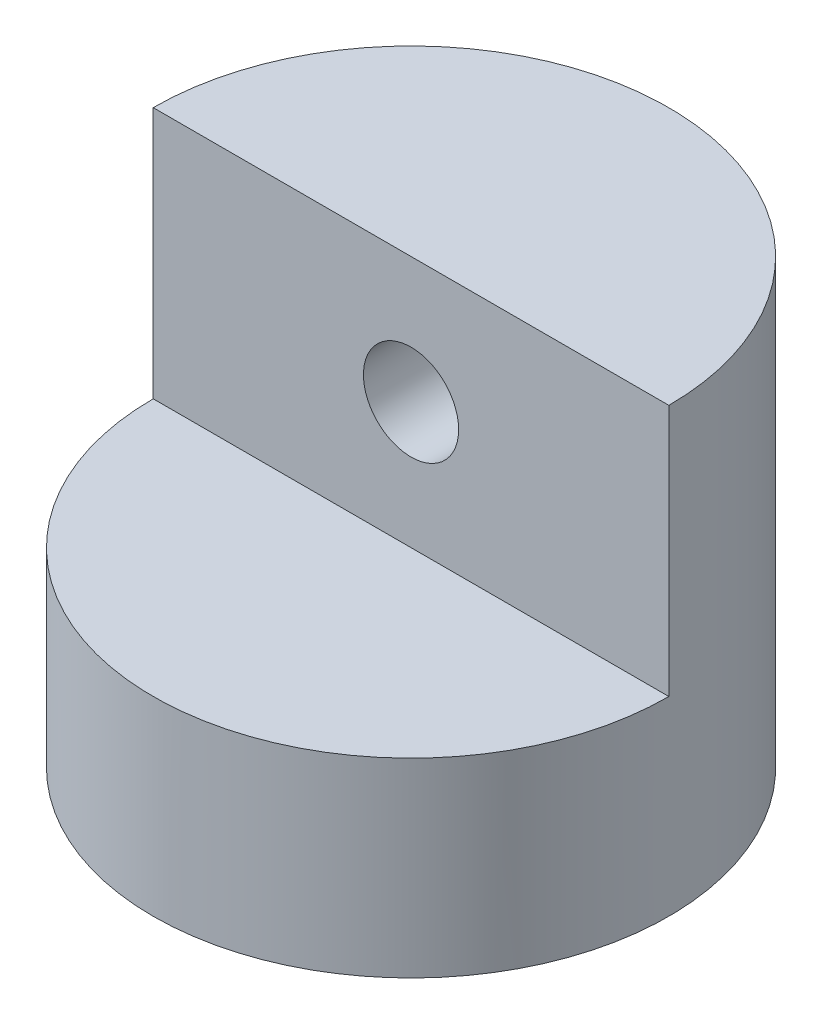
ISO-10303-21;
HEADER;
FILE_DESCRIPTION(('STEP AP214'),'2;1');
FILE_NAME('part.step','',(''),(''),'','','');
FILE_SCHEMA(('AUTOMOTIVE_DESIGN { 1 0 10303 214 1 1 1 1 }'));
ENDSEC;
DATA;
#1=APPLICATION_CONTEXT('core data for automotive mechanical design processes');
#2=APPLICATION_PROTOCOL_DEFINITION('international standard','automotive_design',2000,#1);
#3=PRODUCT_CONTEXT('',#1,'mechanical');
#4=PRODUCT('Part','Part','',(#3));
#5=PRODUCT_RELATED_PRODUCT_CATEGORY('part','',(#4));
#6=PRODUCT_DEFINITION_FORMATION('','',#4);
#7=PRODUCT_DEFINITION_CONTEXT('part definition',#1,'design');
#8=PRODUCT_DEFINITION('design','',#6,#7);
#9=PRODUCT_DEFINITION_SHAPE('','',#8);
#10=(LENGTH_UNIT() NAMED_UNIT(*) SI_UNIT(.MILLI.,.METRE.));
#11=(NAMED_UNIT(*) PLANE_ANGLE_UNIT() SI_UNIT($,.RADIAN.));
#12=(NAMED_UNIT(*) SI_UNIT($,.STERADIAN.) SOLID_ANGLE_UNIT());
#13=UNCERTAINTY_MEASURE_WITH_UNIT(LENGTH_MEASURE(1.E-05),#10,'distance_accuracy_value','');
#14=(GEOMETRIC_REPRESENTATION_CONTEXT(3) GLOBAL_UNCERTAINTY_ASSIGNED_CONTEXT((#13)) GLOBAL_UNIT_ASSIGNED_CONTEXT((#10,
#11,#12)) REPRESENTATION_CONTEXT('',''));
#15=CARTESIAN_POINT('',(0.,0.,0.));
#16=DIRECTION('',(0.,0.,1.));
#17=DIRECTION('',(1.,0.,0.));
#18=AXIS2_PLACEMENT_3D('',#15,#16,#17);
#19=CARTESIAN_POINT('',(0.,55.788,0.));
#20=DIRECTION('',(0.,-1.,0.));
#21=DIRECTION('',(0.,0.,-1.));
#22=AXIS2_PLACEMENT_3D('',#19,#20,#21);
#23=CYLINDRICAL_SURFACE('',#22,32.5);
#24=CARTESIAN_POINT('',(0.,45.894,-32.5));
#25=CARTESIAN_POINT('',(-0.167047387974414,45.8940029510479,-32.5000014014323));
#26=CARTESIAN_POINT('',(-0.334056414535265,45.8870218137109,-32.498709777994));
#27=CARTESIAN_POINT('',(-0.666922031200577,45.8591570671439,-32.4935823968578));
#28=CARTESIAN_POINT('',(-0.83277840485818,45.8382709144761,-32.4897461737147));
#29=CARTESIAN_POINT('',(-1.16218709311425,45.7827385369716,-32.4796320956752));
#30=CARTESIAN_POINT('',(-1.32573803450885,45.7480844426081,-32.4733528444273));
#31=CARTESIAN_POINT('',(-1.64934345668916,45.6652710411314,-32.4585259988948));
#32=CARTESIAN_POINT('',(-1.80939663010089,45.6171067742799,-32.449977571632));
#33=CARTESIAN_POINT('',(-2.12461909376535,45.5077146641441,-32.4308633624607));
#34=CARTESIAN_POINT('',(-2.27979434281073,45.4465035317315,-32.4203001629443));
#35=CARTESIAN_POINT('',(-2.58446206954015,45.3114103037928,-32.3974366809218));
#36=CARTESIAN_POINT('',(-2.73395242740515,45.2375235372098,-32.3851357583491));
#37=CARTESIAN_POINT('',(-3.0261060502108,45.0776663224003,-32.3591437290318));
#38=CARTESIAN_POINT('',(-3.16877249289802,44.9917015735252,-32.3454532788178));
#39=CARTESIAN_POINT('',(-3.44644953798865,44.808233178875,-32.3170461894859));
#40=CARTESIAN_POINT('',(-3.5814572600222,44.7107252338195,-32.3023291688641));
#41=CARTESIAN_POINT('',(-3.84417623264325,44.5038314026624,-32.2721237443791));
#42=CARTESIAN_POINT('',(-3.97180053780938,44.3943360118484,-32.2566290755317));
#43=CARTESIAN_POINT('',(-4.21744501771729,44.1649955424505,-32.2254324395731));
#44=CARTESIAN_POINT('',(-4.33546161754137,44.0451466453241,-32.2097303978036));
#45=CARTESIAN_POINT('',(-4.56100087376238,43.7959866047547,-32.1785678807607));
#46=CARTESIAN_POINT('',(-4.6685266280766,43.6666782745123,-32.1631073353135));
#47=CARTESIAN_POINT('',(-4.87241936155105,43.3993949339145,-32.1328517105622));
#48=CARTESIAN_POINT('',(-4.96878221059233,43.2614167447701,-32.1180568787931));
#49=CARTESIAN_POINT('',(-5.15028638072951,42.976734596099,-32.0894539852934));
#50=CARTESIAN_POINT('',(-5.23534055334004,42.8299742402162,-32.075653924559));
#51=CARTESIAN_POINT('',(-5.39279796033512,42.5296208403625,-32.0495569658406));
#52=CARTESIAN_POINT('',(-5.46519645843931,42.3760252652317,-32.0372606311283));
#53=CARTESIAN_POINT('',(-5.59673049546194,42.0631866292106,-32.0145447471987));
#54=CARTESIAN_POINT('',(-5.65587180506681,41.9039460606101,-32.0041243817861));
#55=CARTESIAN_POINT('',(-5.760491398177,41.5808973563502,-31.9854579827382));
#56=CARTESIAN_POINT('',(-5.80596470935163,41.4170875820687,-31.9772127405319));
#57=CARTESIAN_POINT('',(-5.92036897645239,40.9244091594295,-31.9563064605375));
#58=CARTESIAN_POINT('',(-5.9689190107169,40.5903867325286,-31.9471824578801));
#59=CARTESIAN_POINT('',(-6.0093777303918,39.9190057786916,-31.9395955731685));
#60=CARTESIAN_POINT('',(-6.00129133836947,39.5816475442331,-31.9411317645811));
#61=CARTESIAN_POINT('',(-5.92929348899846,38.9174903955482,-31.9545734655921));
#62=CARTESIAN_POINT('',(-5.86609521960248,38.5906116881623,-31.9663464973696));
#63=CARTESIAN_POINT('',(-5.68676990030916,37.9521907023755,-31.9987323168555));
#64=CARTESIAN_POINT('',(-5.57064066366295,37.6406490581874,-32.0193454697757));
#65=CARTESIAN_POINT('',(-5.28805391152012,37.0396356158523,-32.0672268492818));
#66=CARTESIAN_POINT('',(-5.12130716064854,36.750302952439,-32.0945331440214));
#67=CARTESIAN_POINT('',(-4.74242193954203,36.2034561794701,-32.1526990787035));
#68=CARTESIAN_POINT('',(-4.530278998731,35.9459452076288,-32.1835590684723));
#69=CARTESIAN_POINT('',(-4.06277153030441,35.4659275275267,-32.2459333357088));
#70=CARTESIAN_POINT('',(-3.80679653324245,35.2440153110494,-32.2774504088927));
#71=CARTESIAN_POINT('',(-3.26093695329242,34.8461940455438,-32.3371543132372));
#72=CARTESIAN_POINT('',(-2.9710520498581,34.6702854314329,-32.3653411129122));
#73=CARTESIAN_POINT('',(-2.36499021324983,34.3693819960959,-32.4152628733547));
#74=CARTESIAN_POINT('',(-2.04878258243286,34.2444476517934,-32.4369901621846));
#75=CARTESIAN_POINT('',(-1.39937919492225,34.0496330704814,-32.4714852504939));
#76=CARTESIAN_POINT('',(-1.06618519067572,33.9797471664329,-32.4842539722107));
#77=CARTESIAN_POINT('',(-0.397383215203505,33.897837604151,-32.4992669465579));
#78=CARTESIAN_POINT('',(-0.061878248374556,33.8849991718894,-32.5016593853383));
#79=CARTESIAN_POINT('',(0.606484909661265,33.9153653821447,-32.4960590637379));
#80=CARTESIAN_POINT('',(0.939343226021668,33.958567358601,-32.4880667973981));
#81=CARTESIAN_POINT('',(1.59038992422883,34.0991105543012,-32.4626872786007));
#82=CARTESIAN_POINT('',(1.90867005010831,34.1960407881008,-32.4453713741909));
#83=CARTESIAN_POINT('',(2.52446187534885,34.4408453063712,-32.4032781211012));
#84=CARTESIAN_POINT('',(2.82197219688195,34.5887229667393,-32.3785002779893));
#85=CARTESIAN_POINT('',(3.39126548533967,34.9330367309458,-32.3238620342218));
#86=CARTESIAN_POINT('',(3.66274135122632,35.1299723034668,-32.2939504055836));
#87=CARTESIAN_POINT('',(4.16908432952835,35.5661353462449,-32.2324977111764));
#88=CARTESIAN_POINT('',(4.40394813141742,35.805366636785,-32.2009564984004));
#89=CARTESIAN_POINT('',(4.83348551479758,36.323009489889,-32.1393095123828));
#90=CARTESIAN_POINT('',(5.02760384169284,36.6018850371774,-32.1092273941104));
#91=CARTESIAN_POINT('',(5.36623841659489,37.1887786280097,-32.0543763326784));
#92=CARTESIAN_POINT('',(5.51075647264598,37.4967956087587,-32.0296071958606));
#93=CARTESIAN_POINT('',(5.74529998594316,38.1317338687607,-31.9883683472532));
#94=CARTESIAN_POINT('',(5.83558308225324,38.4585575558546,-31.9718594593372));
#95=CARTESIAN_POINT('',(5.9598710985257,39.1232555270963,-31.9489294956881));
#96=CARTESIAN_POINT('',(5.9938821523063,39.4611286027335,-31.9425073204774));
#97=CARTESIAN_POINT('',(6.00189486714629,39.9656781389392,-31.9409937887346));
#98=CARTESIAN_POINT('',(5.99758283494899,40.1322741196854,-31.9418077558083));
#99=CARTESIAN_POINT('',(5.97513253775215,40.4644821130812,-31.9460164877228));
#100=CARTESIAN_POINT('',(5.95699949373228,40.6300944734976,-31.949410278017));
#101=CARTESIAN_POINT('',(5.90703362997939,40.9592156204855,-31.9586855963114));
#102=CARTESIAN_POINT('',(5.87519596756223,41.122723642411,-31.9645680036804));
#103=CARTESIAN_POINT('',(5.79808429743152,41.4463782726521,-31.9786453020169));
#104=CARTESIAN_POINT('',(5.75281510317848,41.6065260631974,-31.9868393645045));
#105=CARTESIAN_POINT('',(5.6492524053349,41.9221766222262,-32.00529184354));
#106=CARTESIAN_POINT('',(5.59097742811479,42.0776856447824,-32.0155473216154));
#107=CARTESIAN_POINT('',(5.46182056358106,42.3831782049627,-32.0378339830431));
#108=CARTESIAN_POINT('',(5.39094316290595,42.5331636861804,-32.049864534186));
#109=CARTESIAN_POINT('',(5.2370452771777,42.8267176587837,-32.0753712303171));
#110=CARTESIAN_POINT('',(5.154019883669,42.9702835255336,-32.0888479590508));
#111=CARTESIAN_POINT('',(4.97646002457542,43.2499304658904,-32.1168634444833));
#112=CARTESIAN_POINT('',(4.88192955508219,43.3860141146111,-32.1314018317353));
#113=CARTESIAN_POINT('',(4.68049098336988,43.6518217116084,-32.1613669342853));
#114=CARTESIAN_POINT('',(4.57341948284921,43.7814207338574,-32.1768036560179));
#115=CARTESIAN_POINT('',(4.34884138360294,44.0311204389516,-32.2079248208257));
#116=CARTESIAN_POINT('',(4.23133849380697,44.1512244692991,-32.2236091742366));
#117=CARTESIAN_POINT('',(3.98659111868758,44.3812385155566,-32.2548029719053));
#118=CARTESIAN_POINT('',(3.85934088957489,44.4911424352006,-32.2703123067585));
#119=CARTESIAN_POINT('',(3.59607102507716,44.6998801206826,-32.3007093143119));
#120=CARTESIAN_POINT('',(3.46005463969105,44.7987179524275,-32.3155972140706));
#121=CARTESIAN_POINT('',(3.17885786431139,44.9855234946824,-32.3444742543555));
#122=CARTESIAN_POINT('',(3.03360543194256,45.073384266206,-32.3584539984354));
#123=CARTESIAN_POINT('',(2.7361329268486,45.2365033626235,-32.384963576446));
#124=CARTESIAN_POINT('',(2.58391544613779,45.3117663279433,-32.3974939437296));
#125=CARTESIAN_POINT('',(2.27362825228653,45.4491215890459,-32.4207463085122));
#126=CARTESIAN_POINT('',(2.11556241225018,45.5112224244255,-32.4314694775916));
#127=CARTESIAN_POINT('',(1.79467228319851,45.6218233939829,-32.4508090321666));
#128=CARTESIAN_POINT('',(1.63184896912177,45.6703262934676,-32.4594258459698));
#129=CARTESIAN_POINT('',(1.22783758338943,45.7722046076489,-32.4776798969894));
#130=CARTESIAN_POINT('',(0.984588736194169,45.8178195540128,-32.4860086220748));
#131=CARTESIAN_POINT('',(0.494198560196146,45.8787147022365,-32.4971675709575));
#132=CARTESIAN_POINT('',(0.247057325390456,45.893995635502,-32.4999979273299));
#133=CARTESIAN_POINT('',(0.,45.894,-32.5));
#134=B_SPLINE_CURVE_WITH_KNOTS('',3,(#24,#25,#26,#27,#28,#29,#30,#31,#32,#33,#34,#35,#36,#37,
#38,#39,#40,#41,#42,#43,#44,#45,#46,#47,#48,#49,#50,#51,#52,#53,#54,#55,#56,#57,#58,#59,#60,#61,
#62,#63,#64,#65,#66,#67,#68,#69,#70,#71,#72,#73,#74,#75,#76,#77,#78,#79,#80,#81,#82,#83,#84,#85,
#86,#87,#88,#89,#90,#91,#92,#93,#94,#95,#96,#97,#98,#99,#100,#101,#102,#103,#104,#105,#106,#107,
#108,#109,#110,#111,#112,#113,#114,#115,#116,#117,#118,#119,#120,#121,#122,#123,#124,#125,#126,
#127,#128,#129,#130,#131,#132,#133),.UNSPECIFIED.,.T.,.F.,(4,2,2,2,2,2,2,2,2,2,2,2,2,2,2,2,2,2,
2,2,2,2,2,2,2,2,2,2,2,2,2,2,2,2,2,2,2,2,2,2,2,2,2,2,2,2,2,2,2,2,2,2,2,2,4),(0.,
0.500925415856107,1.00194248373588,1.50324633759921,2.00473446721871,2.50558409263793,
3.00661868254917,3.5074176336936,4.00840369848706,4.51442366052909,5.02063105435911,
5.52668851124022,6.03293260831374,6.5428761417078,7.05301011052262,7.56292159140477,
8.07301835093451,9.0806475845946,10.088189241028,11.0828828743721,12.0776176054417,
13.0781469402784,14.0787748517291,15.0946807664378,16.1105962851585,17.1277136264852,
18.144726245551,19.147165819545,20.1495577053301,21.1443857119725,22.1392796509597,
23.1447493595254,24.1503099317355,25.1687925873859,26.1872381130497,27.2008065243771,
28.2142644464847,28.7137382676778,29.2130235027488,29.7124853110036,30.2117683427893,
30.7103446486532,31.2087438085096,31.7073449079496,32.2057733184101,32.711626137455,
33.2172998130326,33.7232737924587,34.2290612523622,34.7394448349454,35.2496400010552,
35.7595031320703,36.2692625008281,37.0101317779487,37.7509831912043),.UNSPECIFIED.);
#135=CARTESIAN_POINT('',(0.,45.894,-32.5));
#136=VERTEX_POINT('',#135);
#137=EDGE_CURVE('E88',#136,#136,#134,.T.);
#138=ORIENTED_EDGE('',*,*,#137,.T.);
#139=EDGE_LOOP('',(#138));
#140=FACE_BOUND('',#139,.T.);
#141=CARTESIAN_POINT('',(0.,0.,0.));
#142=DIRECTION('',(0.,1.,0.));
#143=DIRECTION('',(0.,0.,1.));
#144=AXIS2_PLACEMENT_3D('',#141,#142,#143);
#145=CIRCLE('',#144,32.5);
#146=CARTESIAN_POINT('',(0.,0.,32.5));
#147=VERTEX_POINT('',#146);
#148=EDGE_CURVE('E75',#147,#147,#145,.T.);
#149=ORIENTED_EDGE('',*,*,#148,.T.);
#150=EDGE_LOOP('',(#149));
#151=FACE_BOUND('',#150,.T.);
#152=DIRECTION('',(0.,1.,0.));
#153=VECTOR('',#152,1.);
#154=CARTESIAN_POINT('',(-32.5,24.,0.));
#155=LINE('',#154,#153);
#156=CARTESIAN_POINT('',(-32.5,24.,0.));
#157=VERTEX_POINT('',#156);
#158=CARTESIAN_POINT('',(-32.5,55.788,0.));
#159=VERTEX_POINT('',#158);
#160=EDGE_CURVE('E64',#157,#159,#155,.T.);
#161=ORIENTED_EDGE('',*,*,#160,.T.);
#162=CARTESIAN_POINT('',(0.,55.788,0.));
#163=DIRECTION('',(0.,1.,0.));
#164=DIRECTION('',(0.,0.,1.));
#165=AXIS2_PLACEMENT_3D('',#162,#163,#164);
#166=CIRCLE('',#165,32.5);
#167=CARTESIAN_POINT('',(32.5,55.788,0.));
#168=VERTEX_POINT('',#167);
#169=EDGE_CURVE('E44',#168,#159,#166,.T.);
#170=ORIENTED_EDGE('',*,*,#169,.F.);
#171=DIRECTION('',(0.,1.,0.));
#172=VECTOR('',#171,1.);
#173=CARTESIAN_POINT('',(32.5,24.,0.));
#174=LINE('',#173,#172);
#175=CARTESIAN_POINT('',(32.5,24.,0.));
#176=VERTEX_POINT('',#175);
#177=EDGE_CURVE('E51',#176,#168,#174,.T.);
#178=ORIENTED_EDGE('',*,*,#177,.F.);
#179=CARTESIAN_POINT('',(0.,24.,0.));
#180=DIRECTION('',(0.,1.,0.));
#181=DIRECTION('',(0.,0.,1.));
#182=AXIS2_PLACEMENT_3D('',#179,#180,#181);
#183=CIRCLE('',#182,32.5);
#184=EDGE_CURVE('E72',#157,#176,#183,.T.);
#185=ORIENTED_EDGE('',*,*,#184,.F.);
#186=EDGE_LOOP('',(#161,#170,#178,#185));
#187=FACE_BOUND('',#186,.T.);
#188=ADVANCED_FACE('F36',(#140,#151,#187),#23,.T.);
#189=CARTESIAN_POINT('',(0.,55.788,0.));
#190=DIRECTION('',(0.,1.,0.));
#191=DIRECTION('',(0.,0.,1.));
#192=AXIS2_PLACEMENT_3D('',#189,#190,#191);
#193=PLANE('',#192);
#194=ORIENTED_EDGE('',*,*,#169,.T.);
#195=DIRECTION('',(1.,0.,0.));
#196=VECTOR('',#195,1.);
#197=CARTESIAN_POINT('',(0.,55.788,0.));
#198=LINE('',#197,#196);
#199=EDGE_CURVE('E61',#159,#168,#198,.T.);
#200=ORIENTED_EDGE('',*,*,#199,.T.);
#201=EDGE_LOOP('',(#194,#200));
#202=FACE_BOUND('',#201,.T.);
#203=ADVANCED_FACE('F74',(#202),#193,.T.);
#204=CARTESIAN_POINT('',(0.,0.,0.));
#205=DIRECTION('',(0.,1.,0.));
#206=DIRECTION('',(0.,0.,1.));
#207=AXIS2_PLACEMENT_3D('',#204,#205,#206);
#208=PLANE('',#207);
#209=CARTESIAN_POINT('',(0.,0.,0.));
#210=DIRECTION('',(0.,1.,0.));
#211=DIRECTION('',(0.,0.,1.));
#212=AXIS2_PLACEMENT_3D('',#209,#210,#211);
#213=CIRCLE('',#212,8.);
#214=CARTESIAN_POINT('',(0.,0.,8.));
#215=VERTEX_POINT('',#214);
#216=EDGE_CURVE('E11',#215,#215,#213,.F.);
#217=ORIENTED_EDGE('',*,*,#216,.F.);
#218=EDGE_LOOP('',(#217));
#219=FACE_BOUND('',#218,.T.);
#220=ORIENTED_EDGE('',*,*,#148,.F.);
#221=EDGE_LOOP('',(#220));
#222=FACE_BOUND('',#221,.T.);
#223=ADVANCED_FACE('F122',(#219,#222),#208,.F.);
#224=CARTESIAN_POINT('',(0.,24.,0.));
#225=DIRECTION('',(0.,0.,1.));
#226=DIRECTION('',(1.,0.,0.));
#227=AXIS2_PLACEMENT_3D('',#224,#225,#226);
#228=PLANE('',#227);
#229=CARTESIAN_POINT('',(0.,39.894,0.));
#230=DIRECTION('',(0.,0.,1.));
#231=DIRECTION('',(1.,0.,0.));
#232=AXIS2_PLACEMENT_3D('',#229,#230,#231);
#233=CIRCLE('',#232,6.);
#234=CARTESIAN_POINT('',(6.,39.894,0.));
#235=VERTEX_POINT('',#234);
#236=EDGE_CURVE('E97',#235,#235,#233,.T.);
#237=ORIENTED_EDGE('',*,*,#236,.F.);
#238=EDGE_LOOP('',(#237));
#239=FACE_BOUND('',#238,.T.);
#240=ORIENTED_EDGE('',*,*,#199,.F.);
#241=ORIENTED_EDGE('',*,*,#160,.F.);
#242=DIRECTION('',(1.,0.,0.));
#243=VECTOR('',#242,1.);
#244=CARTESIAN_POINT('',(0.,24.,0.));
#245=LINE('',#244,#243);
#246=EDGE_CURVE('E57',#157,#176,#245,.T.);
#247=ORIENTED_EDGE('',*,*,#246,.T.);
#248=ORIENTED_EDGE('',*,*,#177,.T.);
#249=EDGE_LOOP('',(#240,#241,#247,#248));
#250=FACE_BOUND('',#249,.T.);
#251=ADVANCED_FACE('F63',(#239,#250),#228,.T.);
#252=CARTESIAN_POINT('',(0.,24.,0.));
#253=DIRECTION('',(0.,1.,0.));
#254=DIRECTION('',(0.,0.,1.));
#255=AXIS2_PLACEMENT_3D('',#252,#253,#254);
#256=PLANE('',#255);
#257=ORIENTED_EDGE('',*,*,#246,.F.);
#258=ORIENTED_EDGE('',*,*,#184,.T.);
#259=EDGE_LOOP('',(#257,#258));
#260=FACE_BOUND('',#259,.T.);
#261=ADVANCED_FACE('F112',(#260),#256,.T.);
#262=CARTESIAN_POINT('',(0.,-2.,0.));
#263=DIRECTION('',(0.,-1.,0.));
#264=DIRECTION('',(0.,0.,-1.));
#265=AXIS2_PLACEMENT_3D('',#262,#263,#264);
#266=PLANE('',#265);
#267=CARTESIAN_POINT('',(0.,-2.,0.));
#268=DIRECTION('',(0.,-1.,0.));
#269=DIRECTION('',(0.,0.,-1.));
#270=AXIS2_PLACEMENT_3D('',#267,#268,#269);
#271=CIRCLE('',#270,8.);
#272=CARTESIAN_POINT('',(0.,-2.,-8.));
#273=VERTEX_POINT('',#272);
#274=EDGE_CURVE('E68',#273,#273,#271,.T.);
#275=ORIENTED_EDGE('',*,*,#274,.T.);
#276=EDGE_LOOP('',(#275));
#277=FACE_BOUND('',#276,.T.);
#278=CARTESIAN_POINT('',(0.,-2.,0.));
#279=DIRECTION('',(0.,-1.,0.));
#280=DIRECTION('',(0.,0.,-1.));
#281=AXIS2_PLACEMENT_3D('',#278,#279,#280);
#282=CIRCLE('',#281,6.);
#283=CARTESIAN_POINT('',(0.,-2.,-6.));
#284=VERTEX_POINT('',#283);
#285=EDGE_CURVE('E84',#284,#284,#282,.T.);
#286=ORIENTED_EDGE('',*,*,#285,.F.);
#287=EDGE_LOOP('',(#286));
#288=FACE_BOUND('',#287,.T.);
#289=ADVANCED_FACE('F109',(#277,#288),#266,.T.);
#290=CARTESIAN_POINT('',(0.,-2.,0.));
#291=DIRECTION('',(0.,1.,0.));
#292=DIRECTION('',(0.,0.,1.));
#293=AXIS2_PLACEMENT_3D('',#290,#291,#292);
#294=CYLINDRICAL_SURFACE('',#293,8.);
#295=ORIENTED_EDGE('',*,*,#274,.F.);
#296=EDGE_LOOP('',(#295));
#297=FACE_BOUND('',#296,.T.);
#298=ORIENTED_EDGE('',*,*,#216,.T.);
#299=EDGE_LOOP('',(#298));
#300=FACE_BOUND('',#299,.T.);
#301=ADVANCED_FACE('F107',(#297,#300),#294,.T.);
#302=CARTESIAN_POINT('',(0.,-2.,0.));
#303=DIRECTION('',(0.,1.,0.));
#304=DIRECTION('',(0.,0.,1.));
#305=AXIS2_PLACEMENT_3D('',#302,#303,#304);
#306=CYLINDRICAL_SURFACE('',#305,6.);
#307=ORIENTED_EDGE('',*,*,#285,.T.);
#308=EDGE_LOOP('',(#307));
#309=FACE_BOUND('',#308,.T.);
#310=CARTESIAN_POINT('',(0.,0.,0.));
#311=DIRECTION('',(0.,-1.,0.));
#312=DIRECTION('',(0.,0.,-1.));
#313=AXIS2_PLACEMENT_3D('',#310,#311,#312);
#314=CIRCLE('',#313,6.);
#315=CARTESIAN_POINT('',(0.,0.,-6.));
#316=VERTEX_POINT('',#315);
#317=EDGE_CURVE('E85',#316,#316,#314,.T.);
#318=ORIENTED_EDGE('',*,*,#317,.F.);
#319=EDGE_LOOP('',(#318));
#320=FACE_BOUND('',#319,.T.);
#321=ADVANCED_FACE('F104',(#309,#320),#306,.F.);
#322=ORIENTED_EDGE('',*,*,#317,.T.);
#323=EDGE_LOOP('',(#322));
#324=FACE_BOUND('',#323,.T.);
#325=ADVANCED_FACE('F102',(#324),#208,.F.);
#326=CARTESIAN_POINT('',(0.,39.894,-46.));
#327=DIRECTION('',(0.,0.,1.));
#328=DIRECTION('',(1.,0.,0.));
#329=AXIS2_PLACEMENT_3D('',#326,#327,#328);
#330=CYLINDRICAL_SURFACE('',#329,6.);
#331=ORIENTED_EDGE('',*,*,#236,.T.);
#332=EDGE_LOOP('',(#331));
#333=FACE_BOUND('',#332,.T.);
#334=ORIENTED_EDGE('',*,*,#137,.F.);
#335=EDGE_LOOP('',(#334));
#336=FACE_BOUND('',#335,.T.);
#337=ADVANCED_FACE('F98',(#333,#336),#330,.F.);
#338=CLOSED_SHELL('',(#188,#203,#223,#251,#261,#289,#301,#321,#325,#337));
#339=MANIFOLD_SOLID_BREP('B2',#338);
#340=ADVANCED_BREP_SHAPE_REPRESENTATION('',(#18,#339),#14);
#341=SHAPE_DEFINITION_REPRESENTATION(#9,#340);
ENDSEC;
END-ISO-10303-21;
